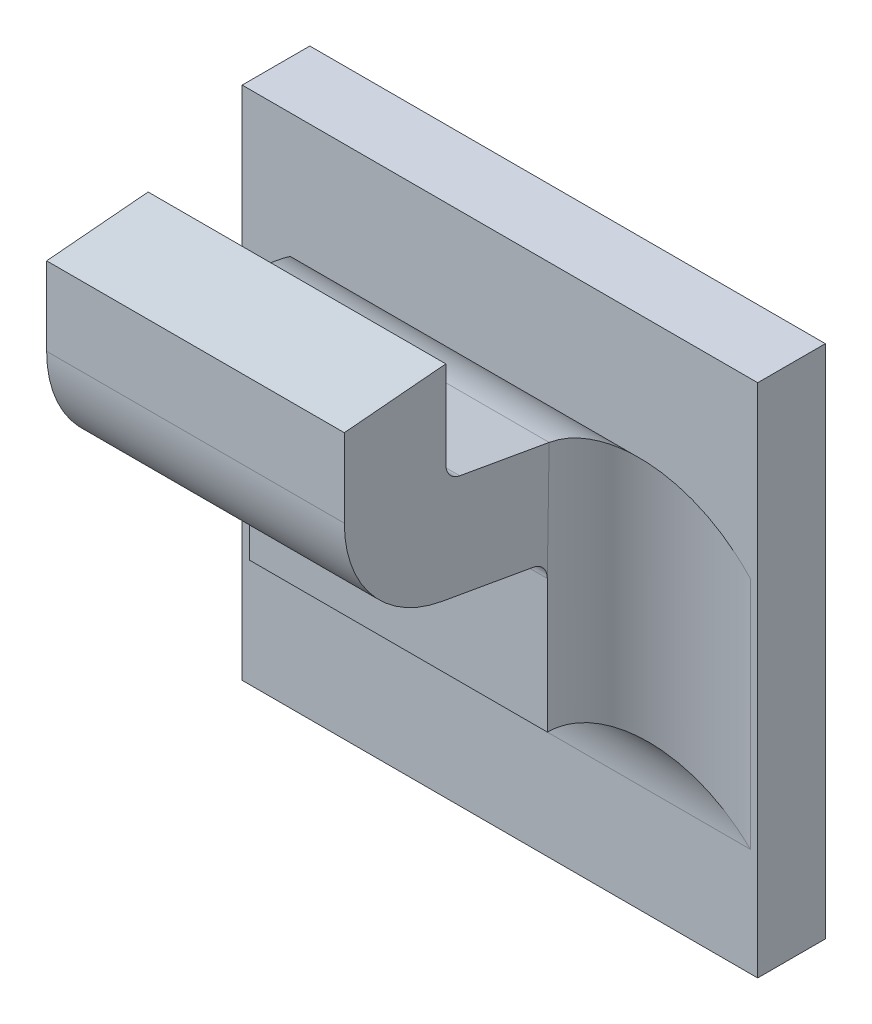
ISO-10303-21;
HEADER;
FILE_DESCRIPTION(('STEP AP214'),'2;1');
FILE_NAME('part.step','',(''),(''),'','','');
FILE_SCHEMA(('AUTOMOTIVE_DESIGN { 1 0 10303 214 1 1 1 1 }'));
ENDSEC;
DATA;
#1=APPLICATION_CONTEXT('core data for automotive mechanical design processes');
#2=APPLICATION_PROTOCOL_DEFINITION('international standard','automotive_design',2000,#1);
#3=PRODUCT_CONTEXT('',#1,'mechanical');
#4=PRODUCT('Part','Part','',(#3));
#5=PRODUCT_RELATED_PRODUCT_CATEGORY('part','',(#4));
#6=PRODUCT_DEFINITION_FORMATION('','',#4);
#7=PRODUCT_DEFINITION_CONTEXT('part definition',#1,'design');
#8=PRODUCT_DEFINITION('design','',#6,#7);
#9=PRODUCT_DEFINITION_SHAPE('','',#8);
#10=(LENGTH_UNIT() NAMED_UNIT(*) SI_UNIT(.MILLI.,.METRE.));
#11=(NAMED_UNIT(*) PLANE_ANGLE_UNIT() SI_UNIT($,.RADIAN.));
#12=(NAMED_UNIT(*) SI_UNIT($,.STERADIAN.) SOLID_ANGLE_UNIT());
#13=UNCERTAINTY_MEASURE_WITH_UNIT(LENGTH_MEASURE(1.E-05),#10,'distance_accuracy_value','');
#14=(GEOMETRIC_REPRESENTATION_CONTEXT(3) GLOBAL_UNCERTAINTY_ASSIGNED_CONTEXT((#13)) GLOBAL_UNIT_ASSIGNED_CONTEXT((#10,
#11,#12)) REPRESENTATION_CONTEXT('',''));
#15=CARTESIAN_POINT('',(0.,0.,0.));
#16=DIRECTION('',(0.,0.,1.));
#17=DIRECTION('',(1.,0.,0.));
#18=AXIS2_PLACEMENT_3D('',#15,#16,#17);
#19=CARTESIAN_POINT('',(-1.26888809134313,-0.481303520617574,0.0797273267071123));
#20=DIRECTION('',(1.,0.,0.));
#21=DIRECTION('',(0.,1.,0.));
#22=AXIS2_PLACEMENT_3D('',#19,#20,#21);
#23=CYLINDRICAL_SURFACE('',#22,0.00098425196850394);
#24=DIRECTION('',(1.,0.,0.));
#25=VECTOR('',#24,1.);
#26=CARTESIAN_POINT('',(-1.28794320945337,-0.481303520617574,0.0807115786756163));
#27=LINE('',#26,#25);
#28=CARTESIAN_POINT('',(-1.26975423307541,-0.481303520617574,0.0807115786756163));
#29=VERTEX_POINT('',#28);
#30=CARTESIAN_POINT('',(-1.28707706772108,-0.481303520617574,0.0807115786756163));
#31=VERTEX_POINT('',#30);
#32=EDGE_CURVE('E182',#29,#31,#27,.F.);
#33=ORIENTED_EDGE('',*,*,#32,.F.);
#34=CARTESIAN_POINT('',(-1.26975423307541,-0.481303520617574,0.0797273267071123));
#35=DIRECTION('',(1.,0.,0.));
#36=DIRECTION('',(0.,1.,0.));
#37=AXIS2_PLACEMENT_3D('',#34,#35,#36);
#38=CIRCLE('',#37,0.00098425196850394);
#39=CARTESIAN_POINT('',(-1.26975423307541,-0.482272819587074,0.0798982402678081));
#40=VERTEX_POINT('',#39);
#41=EDGE_CURVE('E155',#40,#29,#38,.F.);
#42=ORIENTED_EDGE('',*,*,#41,.F.);
#43=DIRECTION('',(1.,0.,0.));
#44=VECTOR('',#43,1.);
#45=CARTESIAN_POINT('',(-1.28794740223802,-0.482272819587074,0.0798982402678081));
#46=LINE('',#45,#44);
#47=CARTESIAN_POINT('',(-1.28707706772108,-0.482272819587074,0.0798982402678081));
#48=VERTEX_POINT('',#47);
#49=EDGE_CURVE('E137',#48,#40,#46,.T.);
#50=ORIENTED_EDGE('',*,*,#49,.F.);
#51=CARTESIAN_POINT('',(-1.28707706772108,-0.481303520617574,0.0797273267071123));
#52=DIRECTION('',(1.,0.,0.));
#53=DIRECTION('',(0.,1.,0.));
#54=AXIS2_PLACEMENT_3D('',#51,#52,#53);
#55=CIRCLE('',#54,0.00098425196850394);
#56=EDGE_CURVE('E148',#48,#31,#55,.F.);
#57=ORIENTED_EDGE('',*,*,#56,.T.);
#58=EDGE_LOOP('',(#33,#42,#50,#57));
#59=FACE_BOUND('',#58,.T.);
#60=ADVANCED_FACE('F17',(#59),#23,.F.);
#61=CARTESIAN_POINT('',(-1.28794320945337,-0.481557363411449,0.0807115786756163));
#62=DIRECTION('',(0.,0.,-1.));
#63=DIRECTION('',(0.,1.,0.));
#64=AXIS2_PLACEMENT_3D('',#61,#62,#63);
#65=PLANE('',#64);
#66=ORIENTED_EDGE('',*,*,#32,.T.);
#67=DIRECTION('',(0.,1.,0.));
#68=VECTOR('',#67,1.);
#69=CARTESIAN_POINT('',(-1.28707706772108,-0.490681533548079,0.0807115786756163));
#70=LINE('',#69,#68);
#71=CARTESIAN_POINT('',(-1.28707706772108,-0.476226664740066,0.0807115786756163));
#72=VERTEX_POINT('',#71);
#73=EDGE_CURVE('E177',#31,#72,#70,.T.);
#74=ORIENTED_EDGE('',*,*,#73,.T.);
#75=DIRECTION('',(1.,0.,0.));
#76=VECTOR('',#75,1.);
#77=CARTESIAN_POINT('',(-1.24091565039825,-0.476226664740067,0.0807115786756162));
#78=LINE('',#77,#76);
#79=CARTESIAN_POINT('',(-1.26975423307541,-0.476226664740066,0.0807115786756163));
#80=VERTEX_POINT('',#79);
#81=EDGE_CURVE('E170',#72,#80,#78,.T.);
#82=ORIENTED_EDGE('',*,*,#81,.T.);
#83=DIRECTION('',(0.,1.,0.));
#84=VECTOR('',#83,1.);
#85=CARTESIAN_POINT('',(-1.26975423307541,-0.490681533548079,0.0807115786756163));
#86=LINE('',#85,#84);
#87=EDGE_CURVE('E189',#29,#80,#86,.T.);
#88=ORIENTED_EDGE('',*,*,#87,.F.);
#89=EDGE_LOOP('',(#66,#74,#82,#88));
#90=FACE_BOUND('',#89,.T.);
#91=ADVANCED_FACE('F376',(#90),#65,.T.);
#92=CARTESIAN_POINT('',(-1.24091565039825,-0.476585262158006,0.0848103659183002));
#93=DIRECTION('',(0.,-0.996194698091746,-0.0871557427476516));
#94=DIRECTION('',(0.,0.0871557427476516,-0.996194698091746));
#95=AXIS2_PLACEMENT_3D('',#92,#93,#94);
#96=PLANE('',#95);
#97=DIRECTION('',(0.,-0.0871557427476615,0.996194698091745));
#98=VECTOR('',#97,1.);
#99=CARTESIAN_POINT('',(-1.28707706772108,-0.476226664740066,0.0807115786756163));
#100=LINE('',#99,#98);
#101=CARTESIAN_POINT('',(-1.28707706772108,-0.476743330075849,0.08661709048664));
#102=VERTEX_POINT('',#101);
#103=EDGE_CURVE('E173',#72,#102,#100,.T.);
#104=ORIENTED_EDGE('',*,*,#103,.T.);
#105=DIRECTION('',(1.,0.,0.));
#106=VECTOR('',#105,1.);
#107=CARTESIAN_POINT('',(-1.28794320945337,-0.476743330075849,0.0866170904866399));
#108=LINE('',#107,#106);
#109=CARTESIAN_POINT('',(-1.26975423307541,-0.476743330075849,0.0866170904866399));
#110=VERTEX_POINT('',#109);
#111=EDGE_CURVE('E167',#102,#110,#108,.T.);
#112=ORIENTED_EDGE('',*,*,#111,.T.);
#113=DIRECTION('',(0.,-0.0871557427476615,0.996194698091745));
#114=VECTOR('',#113,1.);
#115=CARTESIAN_POINT('',(-1.26975423307541,-0.476226664740066,0.0807115786756163));
#116=LINE('',#115,#114);
#117=EDGE_CURVE('E186',#80,#110,#116,.T.);
#118=ORIENTED_EDGE('',*,*,#117,.F.);
#119=ORIENTED_EDGE('',*,*,#81,.F.);
#120=EDGE_LOOP('',(#104,#112,#118,#119));
#121=FACE_BOUND('',#120,.T.);
#122=ADVANCED_FACE('F380',(#121),#96,.F.);
#123=CARTESIAN_POINT('',(-1.28794320945337,-0.48153153014466,0.0866170904866399));
#124=DIRECTION('',(0.,0.,-1.));
#125=DIRECTION('',(0.,1.,0.));
#126=AXIS2_PLACEMENT_3D('',#123,#124,#125);
#127=PLANE('',#126);
#128=ORIENTED_EDGE('',*,*,#111,.F.);
#129=DIRECTION('',(0.,1.,0.));
#130=VECTOR('',#129,1.);
#131=CARTESIAN_POINT('',(-1.28707706772108,-0.490681533548079,0.08661709048664));
#132=LINE('',#131,#130);
#133=CARTESIAN_POINT('',(-1.28707706772108,-0.481303520617574,0.0866170904866399));
#134=VERTEX_POINT('',#133);
#135=EDGE_CURVE('E176',#102,#134,#132,.F.);
#136=ORIENTED_EDGE('',*,*,#135,.T.);
#137=DIRECTION('',(1.,0.,0.));
#138=VECTOR('',#137,1.);
#139=CARTESIAN_POINT('',(-1.26888809134313,-0.481303520617574,0.0866170904866399));
#140=LINE('',#139,#138);
#141=CARTESIAN_POINT('',(-1.26975423307541,-0.481303520617574,0.0866170904866399));
#142=VERTEX_POINT('',#141);
#143=EDGE_CURVE('E165',#142,#134,#140,.F.);
#144=ORIENTED_EDGE('',*,*,#143,.F.);
#145=DIRECTION('',(0.,1.,0.));
#146=VECTOR('',#145,1.);
#147=CARTESIAN_POINT('',(-1.26975423307541,-0.490681533548079,0.08661709048664));
#148=LINE('',#147,#146);
#149=EDGE_CURVE('E188',#110,#142,#148,.F.);
#150=ORIENTED_EDGE('',*,*,#149,.F.);
#151=EDGE_LOOP('',(#128,#136,#144,#150));
#152=FACE_BOUND('',#151,.T.);
#153=ADVANCED_FACE('F384',(#152),#127,.F.);
#154=CARTESIAN_POINT('',(-1.26888809134313,-0.481303520617574,0.0797273267071123));
#155=DIRECTION('',(1.,0.,0.));
#156=DIRECTION('',(0.,1.,0.));
#157=AXIS2_PLACEMENT_3D('',#154,#155,#156);
#158=CYLINDRICAL_SURFACE('',#157,0.00688976377952756);
#159=CARTESIAN_POINT('',(-1.26975423307541,-0.481303520617574,0.0797273267071123));
#160=DIRECTION('',(1.,0.,0.));
#161=DIRECTION('',(0.,1.,0.));
#162=AXIS2_PLACEMENT_3D('',#159,#160,#161);
#163=CIRCLE('',#162,0.00688976377952756);
#164=CARTESIAN_POINT('',(-1.26975423307541,-0.488088613404075,0.0809237216319831));
#165=VERTEX_POINT('',#164);
#166=EDGE_CURVE('E146',#142,#165,#163,.T.);
#167=ORIENTED_EDGE('',*,*,#166,.F.);
#168=ORIENTED_EDGE('',*,*,#143,.T.);
#169=CARTESIAN_POINT('',(-1.28707706772108,-0.481303520617574,0.0797273267071123));
#170=DIRECTION('',(1.,0.,0.));
#171=DIRECTION('',(0.,1.,0.));
#172=AXIS2_PLACEMENT_3D('',#169,#170,#171);
#173=CIRCLE('',#172,0.00688976377952756);
#174=CARTESIAN_POINT('',(-1.28707706772108,-0.488088613404075,0.0809237216319831));
#175=VERTEX_POINT('',#174);
#176=EDGE_CURVE('E235',#134,#175,#173,.T.);
#177=ORIENTED_EDGE('',*,*,#176,.T.);
#178=DIRECTION('',(1.,0.,0.));
#179=VECTOR('',#178,1.);
#180=CARTESIAN_POINT('',(-1.28794320945337,-0.488088613404075,0.0809237216319829));
#181=LINE('',#180,#179);
#182=EDGE_CURVE('E138',#175,#165,#181,.T.);
#183=ORIENTED_EDGE('',*,*,#182,.T.);
#184=EDGE_LOOP('',(#167,#168,#177,#183));
#185=FACE_BOUND('',#184,.T.);
#186=ADVANCED_FACE('F388',(#185),#158,.T.);
#187=CARTESIAN_POINT('',(-1.28794320945337,-0.489070672196903,0.0753541894544217));
#188=DIRECTION('',(0.,0.984807753012208,-0.17364817766693));
#189=DIRECTION('',(0.,0.17364817766693,0.984807753012208));
#190=AXIS2_PLACEMENT_3D('',#187,#188,#189);
#191=PLANE('',#190);
#192=DIRECTION('',(1.,0.,0.));
#193=VECTOR('',#192,1.);
#194=CARTESIAN_POINT('',(-1.26888809134313,-0.489023907492483,0.0756194052724008));
#195=LINE('',#194,#193);
#196=CARTESIAN_POINT('',(-1.28707706772108,-0.489023907492483,0.0756194052724008));
#197=VERTEX_POINT('',#196);
#198=CARTESIAN_POINT('',(-1.26975423307541,-0.489023907492483,0.0756194052724008));
#199=VERTEX_POINT('',#198);
#200=EDGE_CURVE('E127',#197,#199,#195,.T.);
#201=ORIENTED_EDGE('',*,*,#200,.T.);
#202=DIRECTION('',(0.,-0.173648177666989,-0.984807753012198));
#203=VECTOR('',#202,1.);
#204=CARTESIAN_POINT('',(-1.26975423307541,-0.488088613404075,0.0809237216319829));
#205=LINE('',#204,#203);
#206=EDGE_CURVE('E130',#165,#199,#205,.T.);
#207=ORIENTED_EDGE('',*,*,#206,.F.);
#208=ORIENTED_EDGE('',*,*,#182,.F.);
#209=DIRECTION('',(0.,-0.173648177666989,-0.984807753012198));
#210=VECTOR('',#209,1.);
#211=CARTESIAN_POINT('',(-1.28707706772108,-0.488088613404075,0.0809237216319829));
#212=LINE('',#211,#210);
#213=EDGE_CURVE('E132',#175,#197,#212,.T.);
#214=ORIENTED_EDGE('',*,*,#213,.T.);
#215=EDGE_LOOP('',(#201,#207,#208,#214));
#216=FACE_BOUND('',#215,.T.);
#217=ADVANCED_FACE('F129',(#216),#191,.F.);
#218=CARTESIAN_POINT('',(-1.26888809134313,-0.489993206461983,0.0757903188330966));
#219=DIRECTION('',(1.,0.,0.));
#220=DIRECTION('',(0.,1.,0.));
#221=AXIS2_PLACEMENT_3D('',#218,#219,#220);
#222=CYLINDRICAL_SURFACE('',#221,0.00098425196850394);
#223=DIRECTION('',(1.,0.,0.));
#224=VECTOR('',#223,1.);
#225=CARTESIAN_POINT('',(-1.28794320945337,-0.489993206461983,0.0748060668645926));
#226=LINE('',#225,#224);
#227=CARTESIAN_POINT('',(-1.28707706772108,-0.489993206461983,0.0748060668645927));
#228=VERTEX_POINT('',#227);
#229=CARTESIAN_POINT('',(-1.26975423307541,-0.489993206461983,0.0748060668645926));
#230=VERTEX_POINT('',#229);
#231=EDGE_CURVE('E151',#228,#230,#226,.T.);
#232=ORIENTED_EDGE('',*,*,#231,.T.);
#233=CARTESIAN_POINT('',(-1.26975423307541,-0.489993206461983,0.0757903188330966));
#234=DIRECTION('',(1.,0.,0.));
#235=DIRECTION('',(0.,1.,0.));
#236=AXIS2_PLACEMENT_3D('',#233,#234,#235);
#237=CIRCLE('',#236,0.00098425196850394);
#238=EDGE_CURVE('E20',#199,#230,#237,.F.);
#239=ORIENTED_EDGE('',*,*,#238,.F.);
#240=ORIENTED_EDGE('',*,*,#200,.F.);
#241=CARTESIAN_POINT('',(-1.28707706772108,-0.489993206461983,0.0757903188330966));
#242=DIRECTION('',(1.,0.,0.));
#243=DIRECTION('',(0.,1.,0.));
#244=AXIS2_PLACEMENT_3D('',#241,#242,#243);
#245=CIRCLE('',#244,0.00098425196850394);
#246=EDGE_CURVE('E232',#197,#228,#245,.F.);
#247=ORIENTED_EDGE('',*,*,#246,.T.);
#248=EDGE_LOOP('',(#232,#239,#240,#247));
#249=FACE_BOUND('',#248,.T.);
#250=ADVANCED_FACE('F150',(#249),#222,.F.);
#251=CARTESIAN_POINT('',(-1.28794740223802,-0.483254878379902,0.0743287080902469));
#252=DIRECTION('',(0.,0.984807753012208,-0.17364817766693));
#253=DIRECTION('',(0.,0.17364817766693,0.984807753012208));
#254=AXIS2_PLACEMENT_3D('',#251,#252,#253);
#255=PLANE('',#254);
#256=DIRECTION('',(0.,0.173648177666938,0.984807753012207));
#257=VECTOR('',#256,1.);
#258=CARTESIAN_POINT('',(-1.26975423307541,-0.483170707148507,0.0748060668645927));
#259=LINE('',#258,#257);
#260=CARTESIAN_POINT('',(-1.26975232726421,-0.483189410411994,0.0746999953864093));
#261=VERTEX_POINT('',#260);
#262=EDGE_CURVE('E153',#261,#40,#259,.T.);
#263=ORIENTED_EDGE('',*,*,#262,.F.);
#264=DIRECTION('',(1.,0.,0.));
#265=VECTOR('',#264,1.);
#266=CARTESIAN_POINT('',(-1.262392028351,-0.483208113675482,0.0745939239082259));
#267=LINE('',#266,#265);
#268=CARTESIAN_POINT('',(-1.28707897353229,-0.483189410411994,0.0746999953864093));
#269=VERTEX_POINT('',#268);
#270=EDGE_CURVE('E264',#269,#261,#267,.T.);
#271=ORIENTED_EDGE('',*,*,#270,.F.);
#272=DIRECTION('',(0.,0.173648177666938,0.984807753012207));
#273=VECTOR('',#272,1.);
#274=CARTESIAN_POINT('',(-1.28707706772108,-0.483170707148507,0.0748060668645927));
#275=LINE('',#274,#273);
#276=EDGE_CURVE('E234',#269,#48,#275,.T.);
#277=ORIENTED_EDGE('',*,*,#276,.T.);
#278=ORIENTED_EDGE('',*,*,#49,.T.);
#279=EDGE_LOOP('',(#263,#271,#277,#278));
#280=FACE_BOUND('',#279,.T.);
#281=ADVANCED_FACE('F373',(#280),#255,.T.);
#282=CARTESIAN_POINT('',(-1.26975423307541,-0.490681533548079,0.0742155156834903));
#283=DIRECTION('',(1.,0.,0.));
#284=DIRECTION('',(0.,1.,0.));
#285=AXIS2_PLACEMENT_3D('',#282,#283,#284);
#286=PLANE('',#285);
#287=ORIENTED_EDGE('',*,*,#166,.T.);
#288=ORIENTED_EDGE('',*,*,#206,.T.);
#289=ORIENTED_EDGE('',*,*,#238,.T.);
#290=DIRECTION('',(0.,-1.,0.));
#291=VECTOR('',#290,1.);
#292=CARTESIAN_POINT('',(-1.26975423307541,-0.504665225306676,0.0748060668645926));
#293=LINE('',#292,#291);
#294=EDGE_CURVE('E271',#230,#261,#293,.F.);
#295=ORIENTED_EDGE('',*,*,#294,.T.);
#296=ORIENTED_EDGE('',*,*,#262,.T.);
#297=ORIENTED_EDGE('',*,*,#41,.T.);
#298=ORIENTED_EDGE('',*,*,#87,.T.);
#299=ORIENTED_EDGE('',*,*,#117,.T.);
#300=ORIENTED_EDGE('',*,*,#149,.T.);
#301=EDGE_LOOP('',(#287,#288,#289,#295,#296,#297,#298,#299,#300));
#302=FACE_BOUND('',#301,.T.);
#303=ADVANCED_FACE('F142',(#302),#286,.T.);
#304=CARTESIAN_POINT('',(-1.28707706772108,-0.490681533548079,0.0742155156834903));
#305=DIRECTION('',(1.,0.,0.));
#306=DIRECTION('',(0.,1.,0.));
#307=AXIS2_PLACEMENT_3D('',#304,#305,#306);
#308=PLANE('',#307);
#309=DIRECTION('',(0.,1.,0.));
#310=VECTOR('',#309,1.);
#311=CARTESIAN_POINT('',(-1.28707706772109,-0.482147158664785,0.0748060668645927));
#312=LINE('',#311,#310);
#313=EDGE_CURVE('E290',#269,#228,#312,.F.);
#314=ORIENTED_EDGE('',*,*,#313,.T.);
#315=ORIENTED_EDGE('',*,*,#246,.F.);
#316=ORIENTED_EDGE('',*,*,#213,.F.);
#317=ORIENTED_EDGE('',*,*,#176,.F.);
#318=ORIENTED_EDGE('',*,*,#135,.F.);
#319=ORIENTED_EDGE('',*,*,#103,.F.);
#320=ORIENTED_EDGE('',*,*,#73,.F.);
#321=ORIENTED_EDGE('',*,*,#56,.F.);
#322=ORIENTED_EDGE('',*,*,#276,.F.);
#323=EDGE_LOOP('',(#314,#315,#316,#317,#318,#319,#320,#321,#322));
#324=FACE_BOUND('',#323,.T.);
#325=ADVANCED_FACE('F371',(#324),#308,.F.);
#326=CARTESIAN_POINT('',(-1.28794320945337,-0.498123312939428,0.0748060668645926));
#327=DIRECTION('',(0.,0.,-1.));
#328=DIRECTION('',(0.,1.,0.));
#329=AXIS2_PLACEMENT_3D('',#326,#327,#328);
#330=PLANE('',#329);
#331=DIRECTION('',(-1.,0.,0.));
#332=VECTOR('',#331,1.);
#333=CARTESIAN_POINT('',(-1.29443927244549,-0.49773616501193,0.0748060668645926));
#334=LINE('',#333,#332);
#335=CARTESIAN_POINT('',(-1.28707706772109,-0.49773616501193,0.0748060668645926));
#336=VERTEX_POINT('',#335);
#337=CARTESIAN_POINT('',(-1.26975423307541,-0.49773616501193,0.0748060668645926));
#338=VERTEX_POINT('',#337);
#339=EDGE_CURVE('E275',#336,#338,#334,.F.);
#340=ORIENTED_EDGE('',*,*,#339,.T.);
#341=DIRECTION('',(0.,-1.,0.));
#342=VECTOR('',#341,1.);
#343=CARTESIAN_POINT('',(-1.26975423307541,-0.504665225306676,0.0748060668645926));
#344=LINE('',#343,#342);
#345=EDGE_CURVE('E268',#338,#230,#344,.F.);
#346=ORIENTED_EDGE('',*,*,#345,.T.);
#347=ORIENTED_EDGE('',*,*,#231,.F.);
#348=DIRECTION('',(0.,1.,0.));
#349=VECTOR('',#348,1.);
#350=CARTESIAN_POINT('',(-1.28707706772109,-0.482147158664785,0.0748060668645926));
#351=LINE('',#350,#349);
#352=EDGE_CURVE('E293',#228,#336,#351,.F.);
#353=ORIENTED_EDGE('',*,*,#352,.T.);
#354=EDGE_LOOP('',(#340,#346,#347,#353));
#355=FACE_BOUND('',#354,.T.);
#356=ADVANCED_FACE('F369',(#355),#330,.F.);
#357=CARTESIAN_POINT('',(-1.262392028351,-0.489993206461983,0.0757903188330966));
#358=DIRECTION('',(1.,0.,0.));
#359=DIRECTION('',(0.,1.,0.));
#360=AXIS2_PLACEMENT_3D('',#357,#358,#359);
#361=CYLINDRICAL_SURFACE('',#360,0.00688976377952756);
#362=ORIENTED_EDGE('',*,*,#270,.T.);
#363=CARTESIAN_POINT('',(-1.26975322709926,-0.483190299054108,0.0747001216257358));
#364=CARTESIAN_POINT('',(-1.2697483277511,-0.483237076502032,0.074405223433363));
#365=CARTESIAN_POINT('',(-1.26972072512036,-0.48330363441383,0.074115034151789));
#366=CARTESIAN_POINT('',(-1.26962678476824,-0.483470149648069,0.073553844729337));
#367=CARTESIAN_POINT('',(-1.26956081524893,-0.48356978567554,0.0732826892737776));
#368=CARTESIAN_POINT('',(-1.26939683153072,-0.483796900902092,0.0727646055784551));
#369=CARTESIAN_POINT('',(-1.26929895440614,-0.48392426023827,0.0725175794773051));
#370=CARTESIAN_POINT('',(-1.26907735294951,-0.484201625658181,0.0720485533086557));
#371=CARTESIAN_POINT('',(-1.26895356186493,-0.484351689945956,0.0718266201983145));
#372=CARTESIAN_POINT('',(-1.26861729390458,-0.484750708379493,0.0713022915327615));
#373=CARTESIAN_POINT('',(-1.26839184432977,-0.485010979657894,0.0710168133445037));
#374=CARTESIAN_POINT('',(-1.26790976770022,-0.485558615462719,0.070504056702723));
#375=CARTESIAN_POINT('',(-1.26765306917862,-0.485846041744032,0.0702769154978246));
#376=CARTESIAN_POINT('',(-1.26701901897455,-0.486549705339456,0.0698026326616959));
#377=CARTESIAN_POINT('',(-1.26663243034505,-0.486973936440458,0.0695797433223629));
#378=CARTESIAN_POINT('',(-1.26583857417652,-0.487840056506252,0.0692289934880923));
#379=CARTESIAN_POINT('',(-1.26543132238154,-0.488281931974037,0.0691010617693635));
#380=CARTESIAN_POINT('',(-1.26474965449348,-0.489019814551546,0.0689631980798835));
#381=CARTESIAN_POINT('',(-1.26447777461357,-0.489313668588468,0.0689278051732857));
#382=CARTESIAN_POINT('',(-1.26408654119502,-0.4897363315112,0.0689041494171859));
#383=CARTESIAN_POINT('',(-1.26396762576773,-0.489864774668986,0.068900564537093));
#384=CARTESIAN_POINT('',(-1.26384872126439,-0.489993206461983,0.068900555053569));
#385=B_SPLINE_CURVE_WITH_KNOTS('',3,(#363,#364,#365,#366,#367,#368,#369,#370,#371,#372,#373,
#374,#375,#376,#377,#378,#379,#380,#381,#382,#383,#384),.UNSPECIFIED.,.F.,.F.,(4,2,2,2,2,2,2,2,
2,2,4),(0.,0.0008926742756747,0.00177691981761759,0.00265741564567002,0.00354020811045544,
0.00487460341316188,0.00621210995073958,0.00804949445936662,0.00988549942521226,
0.0110894312839999,0.0116145091100795),.UNSPECIFIED.);
#386=CARTESIAN_POINT('',(-1.26384872126439,-0.489993206461983,0.068900555053569));
#387=VERTEX_POINT('',#386);
#388=EDGE_CURVE('E231',#261,#387,#385,.T.);
#389=ORIENTED_EDGE('',*,*,#388,.T.);
#390=DIRECTION('',(1.,0.,0.));
#391=VECTOR('',#390,1.);
#392=CARTESIAN_POINT('',(-1.29491565039825,-0.489993206461983,0.068900555053569));
#393=LINE('',#392,#391);
#394=CARTESIAN_POINT('',(-1.29298257953211,-0.489993206461983,0.068900555053569));
#395=VERTEX_POINT('',#394);
#396=EDGE_CURVE('E195',#395,#387,#393,.T.);
#397=ORIENTED_EDGE('',*,*,#396,.F.);
#398=CARTESIAN_POINT('',(-1.28707807369723,-0.483190299054106,0.0747001216257356));
#399=CARTESIAN_POINT('',(-1.2870829730454,-0.483237076502031,0.0744052234333631));
#400=CARTESIAN_POINT('',(-1.28711057567614,-0.483303634413829,0.0741150341517892));
#401=CARTESIAN_POINT('',(-1.28720451602826,-0.48347014964807,0.0735538447293371));
#402=CARTESIAN_POINT('',(-1.28727048554757,-0.483569785675541,0.0732826892737776));
#403=CARTESIAN_POINT('',(-1.28743446926578,-0.483796900902092,0.0727646055784551));
#404=CARTESIAN_POINT('',(-1.28753234639036,-0.48392426023827,0.072517579477305));
#405=CARTESIAN_POINT('',(-1.28775394784699,-0.484201625658181,0.0720485533086556));
#406=CARTESIAN_POINT('',(-1.28787773893157,-0.484351689945956,0.0718266201983144));
#407=CARTESIAN_POINT('',(-1.28821400689192,-0.484750708379493,0.0713022915327614));
#408=CARTESIAN_POINT('',(-1.28843945646673,-0.485010979657895,0.0710168133445036));
#409=CARTESIAN_POINT('',(-1.28892153309628,-0.485558615462719,0.0705040567027228));
#410=CARTESIAN_POINT('',(-1.28917823161788,-0.485846041744032,0.0702769154978244));
#411=CARTESIAN_POINT('',(-1.28981228182195,-0.486549705339456,0.0698026326616957));
#412=CARTESIAN_POINT('',(-1.29019887045145,-0.486973936440458,0.0695797433223627));
#413=CARTESIAN_POINT('',(-1.29099272661998,-0.487840056506252,0.0692289934880922));
#414=CARTESIAN_POINT('',(-1.29139997841496,-0.488281931974038,0.0691010617693634));
#415=CARTESIAN_POINT('',(-1.29208164630302,-0.489019814551546,0.0689631980798835));
#416=CARTESIAN_POINT('',(-1.29235352618294,-0.489313668588467,0.0689278051732857));
#417=CARTESIAN_POINT('',(-1.29274475960148,-0.489736331511199,0.0689041494171859));
#418=CARTESIAN_POINT('',(-1.29286367502877,-0.489864774668985,0.0689005645370931));
#419=CARTESIAN_POINT('',(-1.29298257953211,-0.489993206461983,0.0689005550535691));
#420=B_SPLINE_CURVE_WITH_KNOTS('',3,(#398,#399,#400,#401,#402,#403,#404,#405,#406,#407,#408,
#409,#410,#411,#412,#413,#414,#415,#416,#417,#418,#419),.UNSPECIFIED.,.F.,.F.,(4,2,2,2,2,2,2,2,
2,2,4),(0.,0.000892674275674762,0.00177691981761787,0.00265741564567031,0.00354020811045574,
0.00487460341316243,0.0062121099507403,0.00804949445936744,0.00988549942521331,
0.0110894312840002,0.0116145091100797),.UNSPECIFIED.);
#421=EDGE_CURVE('E192',#395,#269,#420,.F.);
#422=ORIENTED_EDGE('',*,*,#421,.T.);
#423=EDGE_LOOP('',(#362,#389,#397,#422));
#424=FACE_BOUND('',#423,.T.);
#425=ADVANCED_FACE('F205',(#424),#361,.T.);
#426=CARTESIAN_POINT('',(-1.26384872126439,-0.504665225306676,0.0748060668645926));
#427=DIRECTION('',(0.,-1.,0.));
#428=DIRECTION('',(1.,0.,0.));
#429=AXIS2_PLACEMENT_3D('',#426,#427,#428);
#430=CYLINDRICAL_SURFACE('',#429,0.00590551181102362);
#431=ORIENTED_EDGE('',*,*,#345,.F.);
#432=CARTESIAN_POINT('',(-1.26384872126439,-0.503641676822954,0.0748060668645926));
#433=DIRECTION('',(-0.707106781186548,-0.707106781186547,0.));
#434=DIRECTION('',(0.707106781186547,-0.707106781186548,0.));
#435=AXIS2_PLACEMENT_3D('',#432,#433,#434);
#436=ELLIPSE('',#435,0.0083516548959041,0.00590551181102362);
#437=CARTESIAN_POINT('',(-1.26384872126439,-0.503641676822954,0.068900555053569));
#438=VERTEX_POINT('',#437);
#439=EDGE_CURVE('E281',#338,#438,#436,.T.);
#440=ORIENTED_EDGE('',*,*,#439,.T.);
#441=DIRECTION('',(0.,-1.,0.));
#442=VECTOR('',#441,1.);
#443=CARTESIAN_POINT('',(-1.26384872126439,-0.478412922297737,0.068900555053569));
#444=LINE('',#443,#442);
#445=EDGE_CURVE('E276',#387,#438,#444,.T.);
#446=ORIENTED_EDGE('',*,*,#445,.F.);
#447=ORIENTED_EDGE('',*,*,#388,.F.);
#448=ORIENTED_EDGE('',*,*,#294,.F.);
#449=EDGE_LOOP('',(#431,#440,#446,#447,#448));
#450=FACE_BOUND('',#449,.T.);
#451=ADVANCED_FACE('F219',(#450),#430,.F.);
#452=CARTESIAN_POINT('',(-1.29443927244549,-0.503641676822954,0.0748060668645926));
#453=DIRECTION('',(-1.,0.,0.));
#454=DIRECTION('',(0.,-1.,0.));
#455=AXIS2_PLACEMENT_3D('',#452,#453,#454);
#456=CYLINDRICAL_SURFACE('',#455,0.00590551181102362);
#457=DIRECTION('',(1.,0.,0.));
#458=VECTOR('',#457,1.);
#459=CARTESIAN_POINT('',(-1.29491565039825,-0.503641676822954,0.068900555053569));
#460=LINE('',#459,#458);
#461=CARTESIAN_POINT('',(-1.29298257953211,-0.503641676822954,0.068900555053569));
#462=VERTEX_POINT('',#461);
#463=EDGE_CURVE('E278',#438,#462,#460,.F.);
#464=ORIENTED_EDGE('',*,*,#463,.F.);
#465=ORIENTED_EDGE('',*,*,#439,.F.);
#466=ORIENTED_EDGE('',*,*,#339,.F.);
#467=CARTESIAN_POINT('',(-1.29298257953211,-0.503641676822954,0.0748060668645927));
#468=DIRECTION('',(-0.707106781186547,0.707106781186548,0.));
#469=DIRECTION('',(-0.707106781186548,-0.707106781186547,0.));
#470=AXIS2_PLACEMENT_3D('',#467,#468,#469);
#471=ELLIPSE('',#470,0.0083516548959041,0.00590551181102362);
#472=EDGE_CURVE('E196',#336,#462,#471,.T.);
#473=ORIENTED_EDGE('',*,*,#472,.T.);
#474=EDGE_LOOP('',(#464,#465,#466,#473));
#475=FACE_BOUND('',#474,.T.);
#476=ADVANCED_FACE('F215',(#475),#456,.F.);
#477=CARTESIAN_POINT('',(-1.29298257953211,-0.482147158664785,0.0748060668645927));
#478=DIRECTION('',(0.,1.,0.));
#479=DIRECTION('',(-1.,0.,0.));
#480=AXIS2_PLACEMENT_3D('',#477,#478,#479);
#481=CYLINDRICAL_SURFACE('',#480,0.00590551181102362);
#482=DIRECTION('',(0.,-1.,0.));
#483=VECTOR('',#482,1.);
#484=CARTESIAN_POINT('',(-1.29298257953211,-0.478412922297737,0.068900555053569));
#485=LINE('',#484,#483);
#486=EDGE_CURVE('E283',#462,#395,#485,.F.);
#487=ORIENTED_EDGE('',*,*,#486,.F.);
#488=ORIENTED_EDGE('',*,*,#472,.F.);
#489=ORIENTED_EDGE('',*,*,#352,.F.);
#490=ORIENTED_EDGE('',*,*,#313,.F.);
#491=ORIENTED_EDGE('',*,*,#421,.F.);
#492=EDGE_LOOP('',(#487,#488,#489,#490,#491));
#493=FACE_BOUND('',#492,.T.);
#494=ADVANCED_FACE('F209',(#493),#481,.F.);
#495=CARTESIAN_POINT('',(-1.29491565039825,-0.478412922297737,0.068900555053569));
#496=DIRECTION('',(0.,0.,1.));
#497=DIRECTION('',(0.,-1.,0.));
#498=AXIS2_PLACEMENT_3D('',#495,#496,#497);
#499=PLANE('',#498);
#500=ORIENTED_EDGE('',*,*,#463,.T.);
#501=ORIENTED_EDGE('',*,*,#486,.T.);
#502=ORIENTED_EDGE('',*,*,#396,.T.);
#503=ORIENTED_EDGE('',*,*,#445,.T.);
#504=EDGE_LOOP('',(#500,#501,#502,#503));
#505=FACE_BOUND('',#504,.T.);
#506=DIRECTION('',(0.,-1.,0.));
#507=VECTOR('',#506,1.);
#508=CARTESIAN_POINT('',(-1.26341565039825,-0.478412922297737,0.068900555053569));
#509=LINE('',#508,#507);
#510=CARTESIAN_POINT('',(-1.26341565039825,-0.509912922297737,0.068900555053569));
#511=VERTEX_POINT('',#510);
#512=CARTESIAN_POINT('',(-1.26341565039825,-0.479912922297737,0.068900555053569));
#513=VERTEX_POINT('',#512);
#514=EDGE_CURVE('E300',#511,#513,#509,.F.);
#515=ORIENTED_EDGE('',*,*,#514,.T.);
#516=DIRECTION('',(1.,0.,0.));
#517=VECTOR('',#516,1.);
#518=CARTESIAN_POINT('',(-1.29491565039825,-0.479912922297737,0.068900555053569));
#519=LINE('',#518,#517);
#520=CARTESIAN_POINT('',(-1.29341565039825,-0.479912922297737,0.068900555053569));
#521=VERTEX_POINT('',#520);
#522=EDGE_CURVE('E305',#513,#521,#519,.F.);
#523=ORIENTED_EDGE('',*,*,#522,.T.);
#524=DIRECTION('',(0.,1.,0.));
#525=VECTOR('',#524,1.);
#526=CARTESIAN_POINT('',(-1.29341565039825,-0.511412922297737,0.068900555053569));
#527=LINE('',#526,#525);
#528=CARTESIAN_POINT('',(-1.29341565039825,-0.509912922297737,0.068900555053569));
#529=VERTEX_POINT('',#528);
#530=EDGE_CURVE('E308',#521,#529,#527,.F.);
#531=ORIENTED_EDGE('',*,*,#530,.T.);
#532=DIRECTION('',(-1.,0.,0.));
#533=VECTOR('',#532,1.);
#534=CARTESIAN_POINT('',(-1.26191565039825,-0.509912922297737,0.068900555053569));
#535=LINE('',#534,#533);
#536=EDGE_CURVE('E286',#529,#511,#535,.F.);
#537=ORIENTED_EDGE('',*,*,#536,.T.);
#538=EDGE_LOOP('',(#515,#523,#531,#537));
#539=FACE_BOUND('',#538,.T.);
#540=ADVANCED_FACE('F214',(#505,#539),#499,.T.);
#541=CARTESIAN_POINT('',(-1.26191565039825,-0.509912922297737,0.0647666967858525));
#542=DIRECTION('',(0.,1.,0.));
#543=DIRECTION('',(-1.,0.,0.));
#544=AXIS2_PLACEMENT_3D('',#541,#542,#543);
#545=PLANE('',#544);
#546=DIRECTION('',(0.,0.,1.));
#547=VECTOR('',#546,1.);
#548=CARTESIAN_POINT('',(-1.26341565039825,-0.509912922297737,0.0647666967858525));
#549=LINE('',#548,#547);
#550=CARTESIAN_POINT('',(-1.26341565039825,-0.509912922297737,0.0649635471795533));
#551=VERTEX_POINT('',#550);
#552=EDGE_CURVE('E297',#551,#511,#549,.T.);
#553=ORIENTED_EDGE('',*,*,#552,.T.);
#554=ORIENTED_EDGE('',*,*,#536,.F.);
#555=DIRECTION('',(0.,0.,1.));
#556=VECTOR('',#555,1.);
#557=CARTESIAN_POINT('',(-1.29341565039825,-0.509912922297737,0.0647666967858525));
#558=LINE('',#557,#556);
#559=CARTESIAN_POINT('',(-1.29341565039825,-0.509912922297737,0.0649635471795533));
#560=VERTEX_POINT('',#559);
#561=EDGE_CURVE('E311',#529,#560,#558,.F.);
#562=ORIENTED_EDGE('',*,*,#561,.T.);
#563=DIRECTION('',(1.,0.,0.));
#564=VECTOR('',#563,1.);
#565=CARTESIAN_POINT('',(-1.29491565039825,-0.509912922297737,0.0649635471795533));
#566=LINE('',#565,#564);
#567=EDGE_CURVE('E314',#560,#551,#566,.T.);
#568=ORIENTED_EDGE('',*,*,#567,.T.);
#569=EDGE_LOOP('',(#553,#554,#562,#568));
#570=FACE_BOUND('',#569,.T.);
#571=ADVANCED_FACE('F332',(#570),#545,.F.);
#572=CARTESIAN_POINT('',(-1.26341565039825,-0.478412922297737,0.0647666967858525));
#573=DIRECTION('',(-1.,0.,0.));
#574=DIRECTION('',(0.,-1.,0.));
#575=AXIS2_PLACEMENT_3D('',#572,#573,#574);
#576=PLANE('',#575);
#577=DIRECTION('',(0.,0.,1.));
#578=VECTOR('',#577,1.);
#579=CARTESIAN_POINT('',(-1.26341565039825,-0.479912922297737,0.0647666967858525));
#580=LINE('',#579,#578);
#581=CARTESIAN_POINT('',(-1.26341565039825,-0.479912922297737,0.0649635471795533));
#582=VERTEX_POINT('',#581);
#583=EDGE_CURVE('E302',#582,#513,#580,.T.);
#584=ORIENTED_EDGE('',*,*,#583,.T.);
#585=ORIENTED_EDGE('',*,*,#514,.F.);
#586=ORIENTED_EDGE('',*,*,#552,.F.);
#587=DIRECTION('',(0.,-1.,0.));
#588=VECTOR('',#587,1.);
#589=CARTESIAN_POINT('',(-1.26341565039825,-0.478412922297737,0.0649635471795533));
#590=LINE('',#589,#588);
#591=EDGE_CURVE('E317',#551,#582,#590,.F.);
#592=ORIENTED_EDGE('',*,*,#591,.T.);
#593=EDGE_LOOP('',(#584,#585,#586,#592));
#594=FACE_BOUND('',#593,.T.);
#595=ADVANCED_FACE('F329',(#594),#576,.F.);
#596=CARTESIAN_POINT('',(-1.29491565039825,-0.479912922297737,0.0647666967858525));
#597=DIRECTION('',(0.,-1.,0.));
#598=DIRECTION('',(1.,0.,0.));
#599=AXIS2_PLACEMENT_3D('',#596,#597,#598);
#600=PLANE('',#599);
#601=DIRECTION('',(0.,0.,1.));
#602=VECTOR('',#601,1.);
#603=CARTESIAN_POINT('',(-1.29341565039825,-0.479912922297737,0.0647666967858525));
#604=LINE('',#603,#602);
#605=CARTESIAN_POINT('',(-1.29341565039825,-0.479912922297737,0.0649635471795533));
#606=VERTEX_POINT('',#605);
#607=EDGE_CURVE('E34',#606,#521,#604,.T.);
#608=ORIENTED_EDGE('',*,*,#607,.T.);
#609=ORIENTED_EDGE('',*,*,#522,.F.);
#610=ORIENTED_EDGE('',*,*,#583,.F.);
#611=DIRECTION('',(1.,0.,0.));
#612=VECTOR('',#611,1.);
#613=CARTESIAN_POINT('',(-1.29491565039825,-0.479912922297737,0.0649635471795533));
#614=LINE('',#613,#612);
#615=EDGE_CURVE('E26',#582,#606,#614,.F.);
#616=ORIENTED_EDGE('',*,*,#615,.T.);
#617=EDGE_LOOP('',(#608,#609,#610,#616));
#618=FACE_BOUND('',#617,.T.);
#619=ADVANCED_FACE('F323',(#618),#600,.F.);
#620=CARTESIAN_POINT('',(-1.29341565039825,-0.511412922297737,0.0647666967858525));
#621=DIRECTION('',(1.,0.,0.));
#622=DIRECTION('',(0.,1.,0.));
#623=AXIS2_PLACEMENT_3D('',#620,#621,#622);
#624=PLANE('',#623);
#625=ORIENTED_EDGE('',*,*,#561,.F.);
#626=ORIENTED_EDGE('',*,*,#530,.F.);
#627=ORIENTED_EDGE('',*,*,#607,.F.);
#628=DIRECTION('',(0.,-1.,0.));
#629=VECTOR('',#628,1.);
#630=CARTESIAN_POINT('',(-1.29341565039825,-0.478412922297737,0.0649635471795533));
#631=LINE('',#630,#629);
#632=EDGE_CURVE('E11',#606,#560,#631,.T.);
#633=ORIENTED_EDGE('',*,*,#632,.T.);
#634=EDGE_LOOP('',(#625,#626,#627,#633));
#635=FACE_BOUND('',#634,.T.);
#636=ADVANCED_FACE('F334',(#635),#624,.F.);
#637=CARTESIAN_POINT('',(-1.29491565039825,-0.478412922297737,0.0649635471795533));
#638=DIRECTION('',(0.,0.,1.));
#639=DIRECTION('',(0.,-1.,0.));
#640=AXIS2_PLACEMENT_3D('',#637,#638,#639);
#641=PLANE('',#640);
#642=ORIENTED_EDGE('',*,*,#615,.F.);
#643=ORIENTED_EDGE('',*,*,#591,.F.);
#644=ORIENTED_EDGE('',*,*,#567,.F.);
#645=ORIENTED_EDGE('',*,*,#632,.F.);
#646=EDGE_LOOP('',(#642,#643,#644,#645));
#647=FACE_BOUND('',#646,.T.);
#648=ADVANCED_FACE('F327',(#647),#641,.F.);
#649=CLOSED_SHELL('',(#60,#91,#122,#153,#186,#217,#250,#281,#303,#325,#356,#425,#451,#476,#494,
#540,#571,#595,#619,#636,#648));
#650=MANIFOLD_SOLID_BREP('B1',#649);
#651=ADVANCED_BREP_SHAPE_REPRESENTATION('',(#18,#650),#14);
#652=SHAPE_DEFINITION_REPRESENTATION(#9,#651);
ENDSEC;
END-ISO-10303-21;
